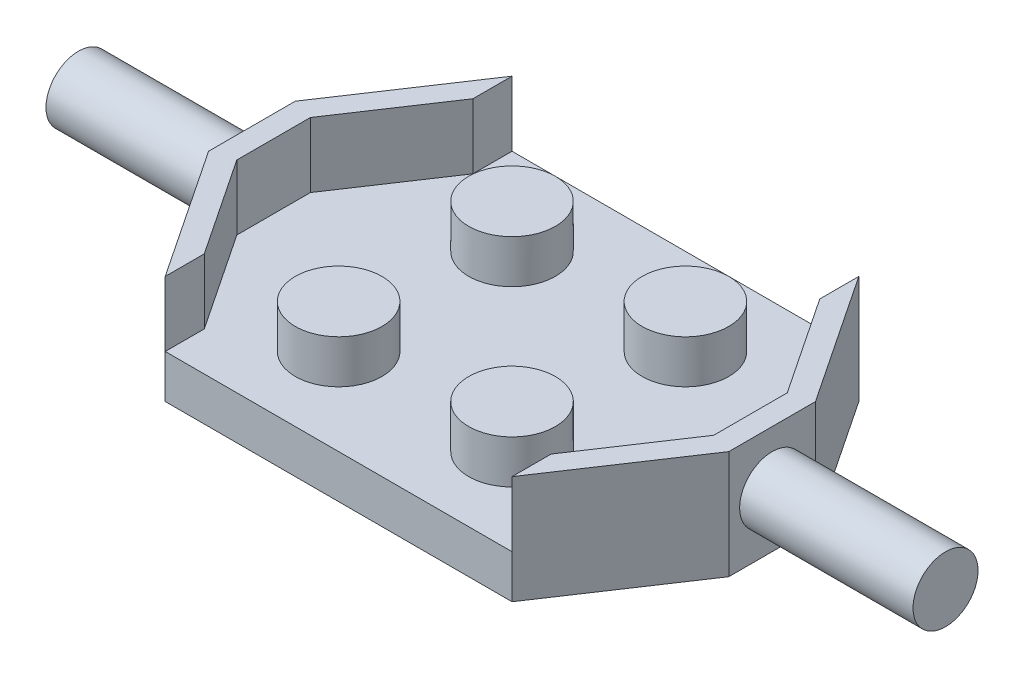
ISO-10303-21;
HEADER;
FILE_DESCRIPTION(('STEP AP214'),'2;1');
FILE_NAME('part.step','',(''),(''),'','','');
FILE_SCHEMA(('AUTOMOTIVE_DESIGN { 1 0 10303 214 1 1 1 1 }'));
ENDSEC;
DATA;
#1=APPLICATION_CONTEXT('core data for automotive mechanical design processes');
#2=APPLICATION_PROTOCOL_DEFINITION('international standard','automotive_design',2000,#1);
#3=PRODUCT_CONTEXT('',#1,'mechanical');
#4=PRODUCT('Part','Part','',(#3));
#5=PRODUCT_RELATED_PRODUCT_CATEGORY('part','',(#4));
#6=PRODUCT_DEFINITION_FORMATION('','',#4);
#7=PRODUCT_DEFINITION_CONTEXT('part definition',#1,'design');
#8=PRODUCT_DEFINITION('design','',#6,#7);
#9=PRODUCT_DEFINITION_SHAPE('','',#8);
#10=(LENGTH_UNIT() NAMED_UNIT(*) SI_UNIT(.MILLI.,.METRE.));
#11=(NAMED_UNIT(*) PLANE_ANGLE_UNIT() SI_UNIT($,.RADIAN.));
#12=(NAMED_UNIT(*) SI_UNIT($,.STERADIAN.) SOLID_ANGLE_UNIT());
#13=UNCERTAINTY_MEASURE_WITH_UNIT(LENGTH_MEASURE(1.E-05),#10,'distance_accuracy_value','');
#14=(GEOMETRIC_REPRESENTATION_CONTEXT(3) GLOBAL_UNCERTAINTY_ASSIGNED_CONTEXT((#13)) GLOBAL_UNIT_ASSIGNED_CONTEXT((#10,
#11,#12)) REPRESENTATION_CONTEXT('',''));
#15=CARTESIAN_POINT('',(0.,0.,0.));
#16=DIRECTION('',(0.,0.,1.));
#17=DIRECTION('',(1.,0.,0.));
#18=AXIS2_PLACEMENT_3D('',#15,#16,#17);
#19=CARTESIAN_POINT('',(0.,2.,0.));
#20=DIRECTION('',(0.,-1.,0.));
#21=DIRECTION('',(0.,0.,-1.));
#22=AXIS2_PLACEMENT_3D('',#19,#20,#21);
#23=PLANE('',#22);
#24=CARTESIAN_POINT('',(-4.,2.,-4.));
#25=DIRECTION('',(0.,-1.,0.));
#26=DIRECTION('',(0.,0.,-1.));
#27=AXIS2_PLACEMENT_3D('',#24,#25,#26);
#28=CIRCLE('',#27,2.);
#29=CARTESIAN_POINT('',(-4.,2.,-6.));
#30=VERTEX_POINT('',#29);
#31=EDGE_CURVE('E412',#30,#30,#28,.F.);
#32=ORIENTED_EDGE('',*,*,#31,.F.);
#33=EDGE_LOOP('',(#32));
#34=FACE_BOUND('',#33,.T.);
#35=CARTESIAN_POINT('',(-4.,2.,4.));
#36=DIRECTION('',(0.,-1.,0.));
#37=DIRECTION('',(0.,0.,-1.));
#38=AXIS2_PLACEMENT_3D('',#35,#36,#37);
#39=CIRCLE('',#38,2.);
#40=CARTESIAN_POINT('',(-4.,2.,2.));
#41=VERTEX_POINT('',#40);
#42=EDGE_CURVE('E48',#41,#41,#39,.F.);
#43=ORIENTED_EDGE('',*,*,#42,.F.);
#44=EDGE_LOOP('',(#43));
#45=FACE_BOUND('',#44,.T.);
#46=DIRECTION('',(0.,0.,-1.));
#47=VECTOR('',#46,1.);
#48=CARTESIAN_POINT('',(-8.,2.,8.));
#49=LINE('',#48,#47);
#50=CARTESIAN_POINT('',(-8.,2.,8.));
#51=VERTEX_POINT('',#50);
#52=CARTESIAN_POINT('',(-8.,2.,6.197224362268));
#53=VERTEX_POINT('',#52);
#54=EDGE_CURVE('E301',#51,#53,#49,.T.);
#55=ORIENTED_EDGE('',*,*,#54,.F.);
#56=DIRECTION('',(1.,0.,0.));
#57=VECTOR('',#56,1.);
#58=CARTESIAN_POINT('',(-8.,2.,8.));
#59=LINE('',#58,#57);
#60=CARTESIAN_POINT('',(8.,2.,8.));
#61=VERTEX_POINT('',#60);
#62=EDGE_CURVE('E376',#51,#61,#59,.T.);
#63=ORIENTED_EDGE('',*,*,#62,.T.);
#64=DIRECTION('',(0.,0.,-1.));
#65=VECTOR('',#64,1.);
#66=CARTESIAN_POINT('',(8.,2.,8.));
#67=LINE('',#66,#65);
#68=CARTESIAN_POINT('',(8.,2.,6.197224362268));
#69=VERTEX_POINT('',#68);
#70=EDGE_CURVE('E230',#61,#69,#67,.T.);
#71=ORIENTED_EDGE('',*,*,#70,.T.);
#72=DIRECTION('',(0.554700196225229,0.,-0.832050294337843));
#73=VECTOR('',#72,1.);
#74=CARTESIAN_POINT('',(11.,2.,1.69722436226801));
#75=LINE('',#74,#73);
#76=CARTESIAN_POINT('',(11.,2.,1.69722436226801));
#77=VERTEX_POINT('',#76);
#78=EDGE_CURVE('E234',#69,#77,#75,.T.);
#79=ORIENTED_EDGE('',*,*,#78,.T.);
#80=DIRECTION('',(0.,0.,-1.));
#81=VECTOR('',#80,1.);
#82=CARTESIAN_POINT('',(11.,2.,-1.69722436226801));
#83=LINE('',#82,#81);
#84=CARTESIAN_POINT('',(11.,2.,-1.69722436226801));
#85=VERTEX_POINT('',#84);
#86=EDGE_CURVE('E239',#77,#85,#83,.T.);
#87=ORIENTED_EDGE('',*,*,#86,.T.);
#88=DIRECTION('',(-0.554700196225229,0.,-0.832050294337843));
#89=VECTOR('',#88,1.);
#90=CARTESIAN_POINT('',(8.,2.,-6.197224362268));
#91=LINE('',#90,#89);
#92=CARTESIAN_POINT('',(8.,2.,-6.197224362268));
#93=VERTEX_POINT('',#92);
#94=EDGE_CURVE('E203',#85,#93,#91,.T.);
#95=ORIENTED_EDGE('',*,*,#94,.T.);
#96=DIRECTION('',(0.,0.,-1.));
#97=VECTOR('',#96,1.);
#98=CARTESIAN_POINT('',(8.,2.,-6.197224362268));
#99=LINE('',#98,#97);
#100=CARTESIAN_POINT('',(8.,2.,-8.));
#101=VERTEX_POINT('',#100);
#102=EDGE_CURVE('E199',#93,#101,#99,.T.);
#103=ORIENTED_EDGE('',*,*,#102,.T.);
#104=DIRECTION('',(-1.,0.,0.));
#105=VECTOR('',#104,1.);
#106=CARTESIAN_POINT('',(-8.,2.,-8.));
#107=LINE('',#106,#105);
#108=CARTESIAN_POINT('',(-8.,2.,-8.));
#109=VERTEX_POINT('',#108);
#110=EDGE_CURVE('E379',#101,#109,#107,.T.);
#111=ORIENTED_EDGE('',*,*,#110,.T.);
#112=DIRECTION('',(0.,0.,-1.));
#113=VECTOR('',#112,1.);
#114=CARTESIAN_POINT('',(-8.,2.,-6.197224362268));
#115=LINE('',#114,#113);
#116=CARTESIAN_POINT('',(-8.,2.,-6.197224362268));
#117=VERTEX_POINT('',#116);
#118=EDGE_CURVE('E308',#117,#109,#115,.T.);
#119=ORIENTED_EDGE('',*,*,#118,.F.);
#120=DIRECTION('',(0.554700196225229,0.,-0.832050294337843));
#121=VECTOR('',#120,1.);
#122=CARTESIAN_POINT('',(-8.,2.,-6.197224362268));
#123=LINE('',#122,#121);
#124=CARTESIAN_POINT('',(-11.,2.,-1.69722436226801));
#125=VERTEX_POINT('',#124);
#126=EDGE_CURVE('E337',#125,#117,#123,.T.);
#127=ORIENTED_EDGE('',*,*,#126,.F.);
#128=DIRECTION('',(0.,0.,-1.));
#129=VECTOR('',#128,1.);
#130=CARTESIAN_POINT('',(-11.,2.,-1.69722436226801));
#131=LINE('',#130,#129);
#132=CARTESIAN_POINT('',(-11.,2.,1.69722436226801));
#133=VERTEX_POINT('',#132);
#134=EDGE_CURVE('E66',#133,#125,#131,.T.);
#135=ORIENTED_EDGE('',*,*,#134,.F.);
#136=DIRECTION('',(-0.554700196225229,0.,-0.832050294337843));
#137=VECTOR('',#136,1.);
#138=CARTESIAN_POINT('',(-11.,2.,1.69722436226801));
#139=LINE('',#138,#137);
#140=EDGE_CURVE('E61',#53,#133,#139,.T.);
#141=ORIENTED_EDGE('',*,*,#140,.F.);
#142=EDGE_LOOP('',(#55,#63,#71,#79,#87,#95,#103,#111,#119,#127,#135,#141));
#143=FACE_BOUND('',#142,.T.);
#144=CARTESIAN_POINT('',(4.,2.,-4.));
#145=DIRECTION('',(0.,1.,0.));
#146=DIRECTION('',(0.,0.,-1.));
#147=AXIS2_PLACEMENT_3D('',#144,#145,#146);
#148=CIRCLE('',#147,2.);
#149=CARTESIAN_POINT('',(4.,2.,-6.));
#150=VERTEX_POINT('',#149);
#151=EDGE_CURVE('E290',#150,#150,#148,.F.);
#152=ORIENTED_EDGE('',*,*,#151,.T.);
#153=EDGE_LOOP('',(#152));
#154=FACE_BOUND('',#153,.T.);
#155=CARTESIAN_POINT('',(4.,2.,4.));
#156=DIRECTION('',(0.,1.,0.));
#157=DIRECTION('',(0.,0.,-1.));
#158=AXIS2_PLACEMENT_3D('',#155,#156,#157);
#159=CIRCLE('',#158,2.);
#160=CARTESIAN_POINT('',(4.,2.,2.));
#161=VERTEX_POINT('',#160);
#162=EDGE_CURVE('E294',#161,#161,#159,.F.);
#163=ORIENTED_EDGE('',*,*,#162,.T.);
#164=EDGE_LOOP('',(#163));
#165=FACE_BOUND('',#164,.T.);
#166=ADVANCED_FACE('F44',(#34,#45,#143,#154,#165),#23,.F.);
#167=CARTESIAN_POINT('',(-8.,2.,8.));
#168=DIRECTION('',(0.,0.,-1.));
#169=DIRECTION('',(-1.,0.,0.));
#170=AXIS2_PLACEMENT_3D('',#167,#168,#169);
#171=PLANE('',#170);
#172=DIRECTION('',(1.,0.,0.));
#173=VECTOR('',#172,1.);
#174=CARTESIAN_POINT('',(-8.,0.,8.));
#175=LINE('',#174,#173);
#176=CARTESIAN_POINT('',(-8.,0.,8.));
#177=VERTEX_POINT('',#176);
#178=CARTESIAN_POINT('',(8.,0.,8.));
#179=VERTEX_POINT('',#178);
#180=EDGE_CURVE('E375',#177,#179,#175,.T.);
#181=ORIENTED_EDGE('',*,*,#180,.T.);
#182=DIRECTION('',(0.,-1.,0.));
#183=VECTOR('',#182,1.);
#184=CARTESIAN_POINT('',(8.,2.,8.));
#185=LINE('',#184,#183);
#186=EDGE_CURVE('E281',#61,#179,#185,.T.);
#187=ORIENTED_EDGE('',*,*,#186,.F.);
#188=ORIENTED_EDGE('',*,*,#62,.F.);
#189=DIRECTION('',(0.,-1.,0.));
#190=VECTOR('',#189,1.);
#191=CARTESIAN_POINT('',(-8.,2.,8.));
#192=LINE('',#191,#190);
#193=EDGE_CURVE('E384',#51,#177,#192,.T.);
#194=ORIENTED_EDGE('',*,*,#193,.T.);
#195=EDGE_LOOP('',(#181,#187,#188,#194));
#196=FACE_BOUND('',#195,.T.);
#197=ADVANCED_FACE('F46',(#196),#171,.F.);
#198=CARTESIAN_POINT('',(-8.,2.,-8.));
#199=DIRECTION('',(0.,0.,1.));
#200=DIRECTION('',(1.,0.,0.));
#201=AXIS2_PLACEMENT_3D('',#198,#199,#200);
#202=PLANE('',#201);
#203=DIRECTION('',(-1.,0.,0.));
#204=VECTOR('',#203,1.);
#205=CARTESIAN_POINT('',(-8.,0.,-8.));
#206=LINE('',#205,#204);
#207=CARTESIAN_POINT('',(8.,0.,-8.));
#208=VERTEX_POINT('',#207);
#209=CARTESIAN_POINT('',(-8.,0.,-8.));
#210=VERTEX_POINT('',#209);
#211=EDGE_CURVE('E387',#208,#210,#206,.T.);
#212=ORIENTED_EDGE('',*,*,#211,.T.);
#213=DIRECTION('',(0.,-1.,0.));
#214=VECTOR('',#213,1.);
#215=CARTESIAN_POINT('',(-8.,2.,-8.));
#216=LINE('',#215,#214);
#217=EDGE_CURVE('E409',#109,#210,#216,.T.);
#218=ORIENTED_EDGE('',*,*,#217,.F.);
#219=ORIENTED_EDGE('',*,*,#110,.F.);
#220=DIRECTION('',(0.,-1.,0.));
#221=VECTOR('',#220,1.);
#222=CARTESIAN_POINT('',(8.,2.,-8.));
#223=LINE('',#222,#221);
#224=EDGE_CURVE('E191',#101,#208,#223,.T.);
#225=ORIENTED_EDGE('',*,*,#224,.T.);
#226=EDGE_LOOP('',(#212,#218,#219,#225));
#227=FACE_BOUND('',#226,.T.);
#228=ADVANCED_FACE('F524',(#227),#202,.F.);
#229=CARTESIAN_POINT('',(-12.,2.,-2.));
#230=DIRECTION('',(0.832050294337844,0.,0.554700196225229));
#231=DIRECTION('',(0.554700196225229,0.,-0.832050294337844));
#232=AXIS2_PLACEMENT_3D('',#229,#230,#231);
#233=PLANE('',#232);
#234=DIRECTION('',(-0.554700196225229,0.,0.832050294337844));
#235=VECTOR('',#234,1.);
#236=CARTESIAN_POINT('',(-12.,0.,-2.));
#237=LINE('',#236,#235);
#238=CARTESIAN_POINT('',(-12.,0.,-2.));
#239=VERTEX_POINT('',#238);
#240=EDGE_CURVE('E390',#210,#239,#237,.T.);
#241=ORIENTED_EDGE('',*,*,#240,.T.);
#242=DIRECTION('',(0.,-1.,0.));
#243=VECTOR('',#242,1.);
#244=CARTESIAN_POINT('',(-12.,2.,-2.));
#245=LINE('',#244,#243);
#246=CARTESIAN_POINT('',(-12.,5.,-2.));
#247=VERTEX_POINT('',#246);
#248=EDGE_CURVE('E405',#247,#239,#245,.T.);
#249=ORIENTED_EDGE('',*,*,#248,.F.);
#250=DIRECTION('',(-0.554700196225229,0.,0.832050294337844));
#251=VECTOR('',#250,1.);
#252=CARTESIAN_POINT('',(-8.,5.,-8.));
#253=LINE('',#252,#251);
#254=CARTESIAN_POINT('',(-8.,5.,-8.));
#255=VERTEX_POINT('',#254);
#256=EDGE_CURVE('E303',#255,#247,#253,.T.);
#257=ORIENTED_EDGE('',*,*,#256,.F.);
#258=DIRECTION('',(0.,-1.,0.));
#259=VECTOR('',#258,1.);
#260=CARTESIAN_POINT('',(-8.,5.,-8.));
#261=LINE('',#260,#259);
#262=EDGE_CURVE('E330',#255,#109,#261,.T.);
#263=ORIENTED_EDGE('',*,*,#262,.T.);
#264=ORIENTED_EDGE('',*,*,#217,.T.);
#265=EDGE_LOOP('',(#241,#249,#257,#263,#264));
#266=FACE_BOUND('',#265,.T.);
#267=ADVANCED_FACE('F521',(#266),#233,.F.);
#268=CARTESIAN_POINT('',(-12.,2.,2.));
#269=DIRECTION('',(1.,0.,0.));
#270=DIRECTION('',(0.,0.,-1.));
#271=AXIS2_PLACEMENT_3D('',#268,#269,#270);
#272=PLANE('',#271);
#273=CARTESIAN_POINT('',(-12.,2.5,0.));
#274=DIRECTION('',(-1.,0.,0.));
#275=DIRECTION('',(0.,0.,1.));
#276=AXIS2_PLACEMENT_3D('',#273,#274,#275);
#277=CIRCLE('',#276,1.5);
#278=CARTESIAN_POINT('',(-12.,2.5,1.5));
#279=VERTEX_POINT('',#278);
#280=EDGE_CURVE('E11',#279,#279,#277,.T.);
#281=ORIENTED_EDGE('',*,*,#280,.F.);
#282=EDGE_LOOP('',(#281));
#283=FACE_BOUND('',#282,.T.);
#284=DIRECTION('',(0.,0.,1.));
#285=VECTOR('',#284,1.);
#286=CARTESIAN_POINT('',(-12.,0.,2.));
#287=LINE('',#286,#285);
#288=CARTESIAN_POINT('',(-12.,0.,2.));
#289=VERTEX_POINT('',#288);
#290=EDGE_CURVE('E393',#239,#289,#287,.T.);
#291=ORIENTED_EDGE('',*,*,#290,.T.);
#292=DIRECTION('',(0.,-1.,0.));
#293=VECTOR('',#292,1.);
#294=CARTESIAN_POINT('',(-12.,2.,2.));
#295=LINE('',#294,#293);
#296=CARTESIAN_POINT('',(-12.,5.,2.));
#297=VERTEX_POINT('',#296);
#298=EDGE_CURVE('E401',#297,#289,#295,.T.);
#299=ORIENTED_EDGE('',*,*,#298,.F.);
#300=DIRECTION('',(0.,0.,1.));
#301=VECTOR('',#300,1.);
#302=CARTESIAN_POINT('',(-12.,5.,-2.));
#303=LINE('',#302,#301);
#304=EDGE_CURVE('E307',#247,#297,#303,.T.);
#305=ORIENTED_EDGE('',*,*,#304,.F.);
#306=ORIENTED_EDGE('',*,*,#248,.T.);
#307=EDGE_LOOP('',(#291,#299,#305,#306));
#308=FACE_BOUND('',#307,.T.);
#309=ADVANCED_FACE('F517',(#283,#308),#272,.F.);
#310=CARTESIAN_POINT('',(-12.,2.,2.));
#311=DIRECTION('',(0.832050294337844,0.,-0.554700196225229));
#312=DIRECTION('',(-0.554700196225229,0.,-0.832050294337844));
#313=AXIS2_PLACEMENT_3D('',#310,#311,#312);
#314=PLANE('',#313);
#315=DIRECTION('',(0.554700196225229,0.,0.832050294337844));
#316=VECTOR('',#315,1.);
#317=CARTESIAN_POINT('',(-12.,0.,2.));
#318=LINE('',#317,#316);
#319=EDGE_CURVE('E380',#289,#177,#318,.T.);
#320=ORIENTED_EDGE('',*,*,#319,.T.);
#321=ORIENTED_EDGE('',*,*,#193,.F.);
#322=DIRECTION('',(0.,-1.,0.));
#323=VECTOR('',#322,1.);
#324=CARTESIAN_POINT('',(-8.,5.,8.));
#325=LINE('',#324,#323);
#326=CARTESIAN_POINT('',(-8.,5.,8.));
#327=VERTEX_POINT('',#326);
#328=EDGE_CURVE('E363',#327,#51,#325,.T.);
#329=ORIENTED_EDGE('',*,*,#328,.F.);
#330=DIRECTION('',(0.554700196225229,0.,0.832050294337844));
#331=VECTOR('',#330,1.);
#332=CARTESIAN_POINT('',(-12.,5.,2.));
#333=LINE('',#332,#331);
#334=EDGE_CURVE('E312',#297,#327,#333,.T.);
#335=ORIENTED_EDGE('',*,*,#334,.F.);
#336=ORIENTED_EDGE('',*,*,#298,.T.);
#337=EDGE_LOOP('',(#320,#321,#329,#335,#336));
#338=FACE_BOUND('',#337,.T.);
#339=ADVANCED_FACE('F513',(#338),#314,.F.);
#340=CARTESIAN_POINT('',(0.,0.,0.));
#341=DIRECTION('',(0.,-1.,0.));
#342=DIRECTION('',(0.,0.,-1.));
#343=AXIS2_PLACEMENT_3D('',#340,#341,#342);
#344=PLANE('',#343);
#345=ORIENTED_EDGE('',*,*,#180,.F.);
#346=ORIENTED_EDGE('',*,*,#319,.F.);
#347=ORIENTED_EDGE('',*,*,#290,.F.);
#348=ORIENTED_EDGE('',*,*,#240,.F.);
#349=ORIENTED_EDGE('',*,*,#211,.F.);
#350=DIRECTION('',(0.554700196225229,0.,0.832050294337844));
#351=VECTOR('',#350,1.);
#352=CARTESIAN_POINT('',(12.,0.,-2.));
#353=LINE('',#352,#351);
#354=CARTESIAN_POINT('',(12.,0.,-2.));
#355=VERTEX_POINT('',#354);
#356=EDGE_CURVE('E272',#208,#355,#353,.T.);
#357=ORIENTED_EDGE('',*,*,#356,.T.);
#358=DIRECTION('',(0.,0.,1.));
#359=VECTOR('',#358,1.);
#360=CARTESIAN_POINT('',(12.,0.,2.));
#361=LINE('',#360,#359);
#362=CARTESIAN_POINT('',(12.,0.,2.));
#363=VERTEX_POINT('',#362);
#364=EDGE_CURVE('E186',#355,#363,#361,.T.);
#365=ORIENTED_EDGE('',*,*,#364,.T.);
#366=DIRECTION('',(-0.554700196225229,0.,0.832050294337844));
#367=VECTOR('',#366,1.);
#368=CARTESIAN_POINT('',(12.,0.,2.));
#369=LINE('',#368,#367);
#370=EDGE_CURVE('E277',#363,#179,#369,.T.);
#371=ORIENTED_EDGE('',*,*,#370,.T.);
#372=EDGE_LOOP('',(#345,#346,#347,#348,#349,#357,#365,#371));
#373=FACE_BOUND('',#372,.T.);
#374=ADVANCED_FACE('F508',(#373),#344,.T.);
#375=CARTESIAN_POINT('',(-4.,4.,-4.));
#376=DIRECTION('',(0.,-1.,0.));
#377=DIRECTION('',(0.,0.,-1.));
#378=AXIS2_PLACEMENT_3D('',#375,#376,#377);
#379=CYLINDRICAL_SURFACE('',#378,2.);
#380=CARTESIAN_POINT('',(-4.,4.,-4.));
#381=DIRECTION('',(0.,1.,0.));
#382=DIRECTION('',(0.,0.,1.));
#383=AXIS2_PLACEMENT_3D('',#380,#381,#382);
#384=CIRCLE('',#383,2.);
#385=CARTESIAN_POINT('',(-4.,4.,-2.));
#386=VERTEX_POINT('',#385);
#387=EDGE_CURVE('E371',#386,#386,#384,.T.);
#388=ORIENTED_EDGE('',*,*,#387,.F.);
#389=EDGE_LOOP('',(#388));
#390=FACE_BOUND('',#389,.T.);
#391=ORIENTED_EDGE('',*,*,#31,.T.);
#392=EDGE_LOOP('',(#391));
#393=FACE_BOUND('',#392,.T.);
#394=ADVANCED_FACE('F505',(#390,#393),#379,.T.);
#395=CARTESIAN_POINT('',(-4.,4.,-4.));
#396=DIRECTION('',(0.,1.,0.));
#397=DIRECTION('',(0.,0.,1.));
#398=AXIS2_PLACEMENT_3D('',#395,#396,#397);
#399=PLANE('',#398);
#400=ORIENTED_EDGE('',*,*,#387,.T.);
#401=EDGE_LOOP('',(#400));
#402=FACE_BOUND('',#401,.T.);
#403=ADVANCED_FACE('F498',(#402),#399,.T.);
#404=CARTESIAN_POINT('',(-4.,4.,4.));
#405=DIRECTION('',(0.,-1.,0.));
#406=DIRECTION('',(0.,0.,-1.));
#407=AXIS2_PLACEMENT_3D('',#404,#405,#406);
#408=CYLINDRICAL_SURFACE('',#407,2.);
#409=CARTESIAN_POINT('',(-4.,4.,4.));
#410=DIRECTION('',(0.,1.,0.));
#411=DIRECTION('',(0.,0.,-1.));
#412=AXIS2_PLACEMENT_3D('',#409,#410,#411);
#413=CIRCLE('',#412,2.);
#414=CARTESIAN_POINT('',(-4.,4.,2.));
#415=VERTEX_POINT('',#414);
#416=EDGE_CURVE('E367',#415,#415,#413,.T.);
#417=ORIENTED_EDGE('',*,*,#416,.F.);
#418=EDGE_LOOP('',(#417));
#419=FACE_BOUND('',#418,.T.);
#420=ORIENTED_EDGE('',*,*,#42,.T.);
#421=EDGE_LOOP('',(#420));
#422=FACE_BOUND('',#421,.T.);
#423=ADVANCED_FACE('F421',(#419,#422),#408,.T.);
#424=CARTESIAN_POINT('',(-4.,4.,4.));
#425=DIRECTION('',(0.,-1.,0.));
#426=DIRECTION('',(0.,0.,-1.));
#427=AXIS2_PLACEMENT_3D('',#424,#425,#426);
#428=PLANE('',#427);
#429=ORIENTED_EDGE('',*,*,#416,.T.);
#430=EDGE_LOOP('',(#429));
#431=FACE_BOUND('',#430,.T.);
#432=ADVANCED_FACE('F494',(#431),#428,.F.);
#433=CARTESIAN_POINT('',(-8.,5.,8.));
#434=DIRECTION('',(-1.,0.,0.));
#435=DIRECTION('',(0.,0.,1.));
#436=AXIS2_PLACEMENT_3D('',#433,#434,#435);
#437=PLANE('',#436);
#438=ORIENTED_EDGE('',*,*,#54,.T.);
#439=DIRECTION('',(0.,-1.,0.));
#440=VECTOR('',#439,1.);
#441=CARTESIAN_POINT('',(-8.,5.,6.197224362268));
#442=LINE('',#441,#440);
#443=CARTESIAN_POINT('',(-8.,5.,6.197224362268));
#444=VERTEX_POINT('',#443);
#445=EDGE_CURVE('E359',#444,#53,#442,.T.);
#446=ORIENTED_EDGE('',*,*,#445,.F.);
#447=DIRECTION('',(0.,0.,-1.));
#448=VECTOR('',#447,1.);
#449=CARTESIAN_POINT('',(-8.,5.,8.));
#450=LINE('',#449,#448);
#451=EDGE_CURVE('E315',#327,#444,#450,.T.);
#452=ORIENTED_EDGE('',*,*,#451,.F.);
#453=ORIENTED_EDGE('',*,*,#328,.T.);
#454=EDGE_LOOP('',(#438,#446,#452,#453));
#455=FACE_BOUND('',#454,.T.);
#456=ADVANCED_FACE('F490',(#455),#437,.F.);
#457=CARTESIAN_POINT('',(-11.,5.,1.69722436226801));
#458=DIRECTION('',(-0.832050294337843,0.,0.55470019622523));
#459=DIRECTION('',(0.55470019622523,0.,0.832050294337843));
#460=AXIS2_PLACEMENT_3D('',#457,#458,#459);
#461=PLANE('',#460);
#462=ORIENTED_EDGE('',*,*,#140,.T.);
#463=DIRECTION('',(0.,-1.,0.));
#464=VECTOR('',#463,1.);
#465=CARTESIAN_POINT('',(-11.,5.,1.69722436226801));
#466=LINE('',#465,#464);
#467=CARTESIAN_POINT('',(-11.,5.,1.69722436226801));
#468=VERTEX_POINT('',#467);
#469=EDGE_CURVE('E355',#468,#133,#466,.T.);
#470=ORIENTED_EDGE('',*,*,#469,.F.);
#471=DIRECTION('',(-0.554700196225229,0.,-0.832050294337843));
#472=VECTOR('',#471,1.);
#473=CARTESIAN_POINT('',(-11.,5.,1.69722436226801));
#474=LINE('',#473,#472);
#475=EDGE_CURVE('E318',#444,#468,#474,.T.);
#476=ORIENTED_EDGE('',*,*,#475,.F.);
#477=ORIENTED_EDGE('',*,*,#445,.T.);
#478=EDGE_LOOP('',(#462,#470,#476,#477));
#479=FACE_BOUND('',#478,.T.);
#480=ADVANCED_FACE('F486',(#479),#461,.F.);
#481=CARTESIAN_POINT('',(-11.,5.,-1.69722436226801));
#482=DIRECTION('',(-1.,0.,0.));
#483=DIRECTION('',(0.,0.,1.));
#484=AXIS2_PLACEMENT_3D('',#481,#482,#483);
#485=PLANE('',#484);
#486=ORIENTED_EDGE('',*,*,#134,.T.);
#487=DIRECTION('',(0.,-1.,0.));
#488=VECTOR('',#487,1.);
#489=CARTESIAN_POINT('',(-11.,5.,-1.69722436226801));
#490=LINE('',#489,#488);
#491=CARTESIAN_POINT('',(-11.,5.,-1.69722436226801));
#492=VERTEX_POINT('',#491);
#493=EDGE_CURVE('E351',#492,#125,#490,.T.);
#494=ORIENTED_EDGE('',*,*,#493,.F.);
#495=DIRECTION('',(0.,0.,-1.));
#496=VECTOR('',#495,1.);
#497=CARTESIAN_POINT('',(-11.,5.,-1.69722436226801));
#498=LINE('',#497,#496);
#499=EDGE_CURVE('E321',#468,#492,#498,.T.);
#500=ORIENTED_EDGE('',*,*,#499,.F.);
#501=ORIENTED_EDGE('',*,*,#469,.T.);
#502=EDGE_LOOP('',(#486,#494,#500,#501));
#503=FACE_BOUND('',#502,.T.);
#504=ADVANCED_FACE('F482',(#503),#485,.F.);
#505=CARTESIAN_POINT('',(-8.,5.,-6.197224362268));
#506=DIRECTION('',(-0.832050294337843,0.,-0.554700196225229));
#507=DIRECTION('',(-0.554700196225229,0.,0.832050294337844));
#508=AXIS2_PLACEMENT_3D('',#505,#506,#507);
#509=PLANE('',#508);
#510=ORIENTED_EDGE('',*,*,#126,.T.);
#511=DIRECTION('',(0.,-1.,0.));
#512=VECTOR('',#511,1.);
#513=CARTESIAN_POINT('',(-8.,5.,-6.197224362268));
#514=LINE('',#513,#512);
#515=CARTESIAN_POINT('',(-8.,5.,-6.197224362268));
#516=VERTEX_POINT('',#515);
#517=EDGE_CURVE('E347',#516,#117,#514,.T.);
#518=ORIENTED_EDGE('',*,*,#517,.F.);
#519=DIRECTION('',(0.554700196225229,0.,-0.832050294337843));
#520=VECTOR('',#519,1.);
#521=CARTESIAN_POINT('',(-8.,5.,-6.197224362268));
#522=LINE('',#521,#520);
#523=EDGE_CURVE('E324',#492,#516,#522,.T.);
#524=ORIENTED_EDGE('',*,*,#523,.F.);
#525=ORIENTED_EDGE('',*,*,#493,.T.);
#526=EDGE_LOOP('',(#510,#518,#524,#525));
#527=FACE_BOUND('',#526,.T.);
#528=ADVANCED_FACE('F478',(#527),#509,.F.);
#529=CARTESIAN_POINT('',(-8.,5.,-6.197224362268));
#530=DIRECTION('',(-1.,0.,0.));
#531=DIRECTION('',(0.,0.,1.));
#532=AXIS2_PLACEMENT_3D('',#529,#530,#531);
#533=PLANE('',#532);
#534=ORIENTED_EDGE('',*,*,#118,.T.);
#535=ORIENTED_EDGE('',*,*,#262,.F.);
#536=DIRECTION('',(0.,0.,-1.));
#537=VECTOR('',#536,1.);
#538=CARTESIAN_POINT('',(-8.,5.,-6.197224362268));
#539=LINE('',#538,#537);
#540=EDGE_CURVE('E327',#516,#255,#539,.T.);
#541=ORIENTED_EDGE('',*,*,#540,.F.);
#542=ORIENTED_EDGE('',*,*,#517,.T.);
#543=EDGE_LOOP('',(#534,#535,#541,#542));
#544=FACE_BOUND('',#543,.T.);
#545=ADVANCED_FACE('F474',(#544),#533,.F.);
#546=CARTESIAN_POINT('',(0.,5.,0.));
#547=DIRECTION('',(0.,1.,0.));
#548=DIRECTION('',(0.,0.,1.));
#549=AXIS2_PLACEMENT_3D('',#546,#547,#548);
#550=PLANE('',#549);
#551=ORIENTED_EDGE('',*,*,#256,.T.);
#552=ORIENTED_EDGE('',*,*,#304,.T.);
#553=ORIENTED_EDGE('',*,*,#334,.T.);
#554=ORIENTED_EDGE('',*,*,#451,.T.);
#555=ORIENTED_EDGE('',*,*,#475,.T.);
#556=ORIENTED_EDGE('',*,*,#499,.T.);
#557=ORIENTED_EDGE('',*,*,#523,.T.);
#558=ORIENTED_EDGE('',*,*,#540,.T.);
#559=EDGE_LOOP('',(#551,#552,#553,#554,#555,#556,#557,#558));
#560=FACE_BOUND('',#559,.T.);
#561=ADVANCED_FACE('F470',(#560),#550,.T.);
#562=CARTESIAN_POINT('',(-20.,2.5,0.));
#563=DIRECTION('',(1.,0.,0.));
#564=DIRECTION('',(0.,0.,-1.));
#565=AXIS2_PLACEMENT_3D('',#562,#563,#564);
#566=CYLINDRICAL_SURFACE('',#565,1.5);
#567=CARTESIAN_POINT('',(-20.,2.5,0.));
#568=DIRECTION('',(-1.,0.,0.));
#569=DIRECTION('',(0.,0.,1.));
#570=AXIS2_PLACEMENT_3D('',#567,#568,#569);
#571=CIRCLE('',#570,1.5);
#572=CARTESIAN_POINT('',(-20.,2.5,1.5));
#573=VERTEX_POINT('',#572);
#574=EDGE_CURVE('E298',#573,#573,#571,.T.);
#575=ORIENTED_EDGE('',*,*,#574,.F.);
#576=EDGE_LOOP('',(#575));
#577=FACE_BOUND('',#576,.T.);
#578=ORIENTED_EDGE('',*,*,#280,.T.);
#579=EDGE_LOOP('',(#578));
#580=FACE_BOUND('',#579,.T.);
#581=ADVANCED_FACE('F466',(#577,#580),#566,.T.);
#582=CARTESIAN_POINT('',(-20.,2.5,0.));
#583=DIRECTION('',(-1.,0.,0.));
#584=DIRECTION('',(0.,0.,1.));
#585=AXIS2_PLACEMENT_3D('',#582,#583,#584);
#586=PLANE('',#585);
#587=ORIENTED_EDGE('',*,*,#574,.T.);
#588=EDGE_LOOP('',(#587));
#589=FACE_BOUND('',#588,.T.);
#590=ADVANCED_FACE('F463',(#589),#586,.T.);
#591=CARTESIAN_POINT('',(12.,2.,-2.));
#592=DIRECTION('',(-0.832050294337844,0.,0.554700196225229));
#593=DIRECTION('',(-0.554700196225229,0.,-0.832050294337844));
#594=AXIS2_PLACEMENT_3D('',#591,#592,#593);
#595=PLANE('',#594);
#596=ORIENTED_EDGE('',*,*,#356,.F.);
#597=ORIENTED_EDGE('',*,*,#224,.F.);
#598=DIRECTION('',(0.,-1.,0.));
#599=VECTOR('',#598,1.);
#600=CARTESIAN_POINT('',(8.,5.,-8.));
#601=LINE('',#600,#599);
#602=CARTESIAN_POINT('',(8.,5.,-8.));
#603=VERTEX_POINT('',#602);
#604=EDGE_CURVE('E197',#603,#101,#601,.T.);
#605=ORIENTED_EDGE('',*,*,#604,.F.);
#606=DIRECTION('',(0.554700196225229,0.,0.832050294337844));
#607=VECTOR('',#606,1.);
#608=CARTESIAN_POINT('',(8.,5.,-8.));
#609=LINE('',#608,#607);
#610=CARTESIAN_POINT('',(12.,5.,-2.));
#611=VERTEX_POINT('',#610);
#612=EDGE_CURVE('E173',#603,#611,#609,.T.);
#613=ORIENTED_EDGE('',*,*,#612,.T.);
#614=DIRECTION('',(0.,-1.,0.));
#615=VECTOR('',#614,1.);
#616=CARTESIAN_POINT('',(12.,2.,-2.));
#617=LINE('',#616,#615);
#618=EDGE_CURVE('E183',#611,#355,#617,.T.);
#619=ORIENTED_EDGE('',*,*,#618,.T.);
#620=EDGE_LOOP('',(#596,#597,#605,#613,#619));
#621=FACE_BOUND('',#620,.T.);
#622=ADVANCED_FACE('F194',(#621),#595,.F.);
#623=CARTESIAN_POINT('',(12.,2.,2.));
#624=DIRECTION('',(-1.,0.,0.));
#625=DIRECTION('',(0.,0.,-1.));
#626=AXIS2_PLACEMENT_3D('',#623,#624,#625);
#627=PLANE('',#626);
#628=CARTESIAN_POINT('',(12.,2.5,0.));
#629=DIRECTION('',(-1.,0.,0.));
#630=DIRECTION('',(0.,0.,1.));
#631=AXIS2_PLACEMENT_3D('',#628,#629,#630);
#632=CIRCLE('',#631,1.5);
#633=CARTESIAN_POINT('',(12.,2.5,1.5));
#634=VERTEX_POINT('',#633);
#635=EDGE_CURVE('E206',#634,#634,#632,.T.);
#636=ORIENTED_EDGE('',*,*,#635,.T.);
#637=EDGE_LOOP('',(#636));
#638=FACE_BOUND('',#637,.T.);
#639=ORIENTED_EDGE('',*,*,#364,.F.);
#640=ORIENTED_EDGE('',*,*,#618,.F.);
#641=DIRECTION('',(0.,0.,1.));
#642=VECTOR('',#641,1.);
#643=CARTESIAN_POINT('',(12.,5.,-2.));
#644=LINE('',#643,#642);
#645=CARTESIAN_POINT('',(12.,5.,2.));
#646=VERTEX_POINT('',#645);
#647=EDGE_CURVE('E169',#611,#646,#644,.T.);
#648=ORIENTED_EDGE('',*,*,#647,.T.);
#649=DIRECTION('',(0.,-1.,0.));
#650=VECTOR('',#649,1.);
#651=CARTESIAN_POINT('',(12.,2.,2.));
#652=LINE('',#651,#650);
#653=EDGE_CURVE('E192',#646,#363,#652,.T.);
#654=ORIENTED_EDGE('',*,*,#653,.T.);
#655=EDGE_LOOP('',(#639,#640,#648,#654));
#656=FACE_BOUND('',#655,.T.);
#657=ADVANCED_FACE('F184',(#638,#656),#627,.F.);
#658=CARTESIAN_POINT('',(12.,2.,2.));
#659=DIRECTION('',(-0.832050294337844,0.,-0.554700196225229));
#660=DIRECTION('',(0.554700196225229,0.,-0.832050294337844));
#661=AXIS2_PLACEMENT_3D('',#658,#659,#660);
#662=PLANE('',#661);
#663=ORIENTED_EDGE('',*,*,#370,.F.);
#664=ORIENTED_EDGE('',*,*,#653,.F.);
#665=DIRECTION('',(-0.554700196225229,0.,0.832050294337844));
#666=VECTOR('',#665,1.);
#667=CARTESIAN_POINT('',(12.,5.,2.));
#668=LINE('',#667,#666);
#669=CARTESIAN_POINT('',(8.,5.,8.));
#670=VERTEX_POINT('',#669);
#671=EDGE_CURVE('E176',#646,#670,#668,.T.);
#672=ORIENTED_EDGE('',*,*,#671,.T.);
#673=DIRECTION('',(0.,-1.,0.));
#674=VECTOR('',#673,1.);
#675=CARTESIAN_POINT('',(8.,5.,8.));
#676=LINE('',#675,#674);
#677=EDGE_CURVE('E260',#670,#61,#676,.T.);
#678=ORIENTED_EDGE('',*,*,#677,.T.);
#679=ORIENTED_EDGE('',*,*,#186,.T.);
#680=EDGE_LOOP('',(#663,#664,#672,#678,#679));
#681=FACE_BOUND('',#680,.T.);
#682=ADVANCED_FACE('F453',(#681),#662,.F.);
#683=CARTESIAN_POINT('',(4.,4.,-4.));
#684=DIRECTION('',(0.,-1.,0.));
#685=DIRECTION('',(0.,0.,-1.));
#686=AXIS2_PLACEMENT_3D('',#683,#684,#685);
#687=CYLINDRICAL_SURFACE('',#686,2.);
#688=CARTESIAN_POINT('',(4.,4.,-4.));
#689=DIRECTION('',(0.,-1.,0.));
#690=DIRECTION('',(0.,0.,1.));
#691=AXIS2_PLACEMENT_3D('',#688,#689,#690);
#692=CIRCLE('',#691,2.);
#693=CARTESIAN_POINT('',(4.,4.,-2.));
#694=VERTEX_POINT('',#693);
#695=EDGE_CURVE('E268',#694,#694,#692,.T.);
#696=ORIENTED_EDGE('',*,*,#695,.T.);
#697=EDGE_LOOP('',(#696));
#698=FACE_BOUND('',#697,.T.);
#699=ORIENTED_EDGE('',*,*,#151,.F.);
#700=EDGE_LOOP('',(#699));
#701=FACE_BOUND('',#700,.T.);
#702=ADVANCED_FACE('F445',(#698,#701),#687,.T.);
#703=CARTESIAN_POINT('',(4.,4.,-4.));
#704=DIRECTION('',(0.,1.,0.));
#705=DIRECTION('',(0.,0.,1.));
#706=AXIS2_PLACEMENT_3D('',#703,#704,#705);
#707=PLANE('',#706);
#708=ORIENTED_EDGE('',*,*,#695,.F.);
#709=EDGE_LOOP('',(#708));
#710=FACE_BOUND('',#709,.T.);
#711=ADVANCED_FACE('F435',(#710),#707,.T.);
#712=CARTESIAN_POINT('',(4.,4.,4.));
#713=DIRECTION('',(0.,-1.,0.));
#714=DIRECTION('',(0.,0.,-1.));
#715=AXIS2_PLACEMENT_3D('',#712,#713,#714);
#716=CYLINDRICAL_SURFACE('',#715,2.);
#717=CARTESIAN_POINT('',(4.,4.,4.));
#718=DIRECTION('',(0.,-1.,0.));
#719=DIRECTION('',(0.,0.,-1.));
#720=AXIS2_PLACEMENT_3D('',#717,#718,#719);
#721=CIRCLE('',#720,2.);
#722=CARTESIAN_POINT('',(4.,4.,2.));
#723=VERTEX_POINT('',#722);
#724=EDGE_CURVE('E264',#723,#723,#721,.T.);
#725=ORIENTED_EDGE('',*,*,#724,.T.);
#726=EDGE_LOOP('',(#725));
#727=FACE_BOUND('',#726,.T.);
#728=ORIENTED_EDGE('',*,*,#162,.F.);
#729=EDGE_LOOP('',(#728));
#730=FACE_BOUND('',#729,.T.);
#731=ADVANCED_FACE('F432',(#727,#730),#716,.T.);
#732=CARTESIAN_POINT('',(4.,4.,4.));
#733=DIRECTION('',(0.,-1.,0.));
#734=DIRECTION('',(0.,0.,-1.));
#735=AXIS2_PLACEMENT_3D('',#732,#733,#734);
#736=PLANE('',#735);
#737=ORIENTED_EDGE('',*,*,#724,.F.);
#738=EDGE_LOOP('',(#737));
#739=FACE_BOUND('',#738,.T.);
#740=ADVANCED_FACE('F434',(#739),#736,.F.);
#741=CARTESIAN_POINT('',(8.,5.,8.));
#742=DIRECTION('',(1.,0.,0.));
#743=DIRECTION('',(0.,0.,1.));
#744=AXIS2_PLACEMENT_3D('',#741,#742,#743);
#745=PLANE('',#744);
#746=ORIENTED_EDGE('',*,*,#70,.F.);
#747=ORIENTED_EDGE('',*,*,#677,.F.);
#748=DIRECTION('',(0.,0.,-1.));
#749=VECTOR('',#748,1.);
#750=CARTESIAN_POINT('',(8.,5.,8.));
#751=LINE('',#750,#749);
#752=CARTESIAN_POINT('',(8.,5.,6.197224362268));
#753=VERTEX_POINT('',#752);
#754=EDGE_CURVE('E211',#670,#753,#751,.T.);
#755=ORIENTED_EDGE('',*,*,#754,.T.);
#756=DIRECTION('',(0.,-1.,0.));
#757=VECTOR('',#756,1.);
#758=CARTESIAN_POINT('',(8.,5.,6.197224362268));
#759=LINE('',#758,#757);
#760=EDGE_CURVE('E257',#753,#69,#759,.T.);
#761=ORIENTED_EDGE('',*,*,#760,.T.);
#762=EDGE_LOOP('',(#746,#747,#755,#761));
#763=FACE_BOUND('',#762,.T.);
#764=ADVANCED_FACE('F442',(#763),#745,.F.);
#765=CARTESIAN_POINT('',(11.,5.,1.69722436226801));
#766=DIRECTION('',(0.832050294337843,0.,0.55470019622523));
#767=DIRECTION('',(-0.55470019622523,0.,0.832050294337843));
#768=AXIS2_PLACEMENT_3D('',#765,#766,#767);
#769=PLANE('',#768);
#770=ORIENTED_EDGE('',*,*,#78,.F.);
#771=ORIENTED_EDGE('',*,*,#760,.F.);
#772=DIRECTION('',(0.554700196225229,0.,-0.832050294337843));
#773=VECTOR('',#772,1.);
#774=CARTESIAN_POINT('',(11.,5.,1.69722436226801));
#775=LINE('',#774,#773);
#776=CARTESIAN_POINT('',(11.,5.,1.69722436226801));
#777=VERTEX_POINT('',#776);
#778=EDGE_CURVE('E215',#753,#777,#775,.T.);
#779=ORIENTED_EDGE('',*,*,#778,.T.);
#780=DIRECTION('',(0.,-1.,0.));
#781=VECTOR('',#780,1.);
#782=CARTESIAN_POINT('',(11.,5.,1.69722436226801));
#783=LINE('',#782,#781);
#784=EDGE_CURVE('E254',#777,#77,#783,.T.);
#785=ORIENTED_EDGE('',*,*,#784,.T.);
#786=EDGE_LOOP('',(#770,#771,#779,#785));
#787=FACE_BOUND('',#786,.T.);
#788=ADVANCED_FACE('F564',(#787),#769,.F.);
#789=CARTESIAN_POINT('',(11.,5.,-1.69722436226801));
#790=DIRECTION('',(1.,0.,0.));
#791=DIRECTION('',(0.,0.,1.));
#792=AXIS2_PLACEMENT_3D('',#789,#790,#791);
#793=PLANE('',#792);
#794=ORIENTED_EDGE('',*,*,#86,.F.);
#795=ORIENTED_EDGE('',*,*,#784,.F.);
#796=DIRECTION('',(0.,0.,-1.));
#797=VECTOR('',#796,1.);
#798=CARTESIAN_POINT('',(11.,5.,-1.69722436226801));
#799=LINE('',#798,#797);
#800=CARTESIAN_POINT('',(11.,5.,-1.69722436226801));
#801=VERTEX_POINT('',#800);
#802=EDGE_CURVE('E219',#777,#801,#799,.T.);
#803=ORIENTED_EDGE('',*,*,#802,.T.);
#804=DIRECTION('',(0.,-1.,0.));
#805=VECTOR('',#804,1.);
#806=CARTESIAN_POINT('',(11.,5.,-1.69722436226801));
#807=LINE('',#806,#805);
#808=EDGE_CURVE('E251',#801,#85,#807,.T.);
#809=ORIENTED_EDGE('',*,*,#808,.T.);
#810=EDGE_LOOP('',(#794,#795,#803,#809));
#811=FACE_BOUND('',#810,.T.);
#812=ADVANCED_FACE('F567',(#811),#793,.F.);
#813=CARTESIAN_POINT('',(8.,5.,-6.197224362268));
#814=DIRECTION('',(0.832050294337843,0.,-0.554700196225229));
#815=DIRECTION('',(0.554700196225229,0.,0.832050294337844));
#816=AXIS2_PLACEMENT_3D('',#813,#814,#815);
#817=PLANE('',#816);
#818=ORIENTED_EDGE('',*,*,#94,.F.);
#819=ORIENTED_EDGE('',*,*,#808,.F.);
#820=DIRECTION('',(-0.554700196225229,0.,-0.832050294337843));
#821=VECTOR('',#820,1.);
#822=CARTESIAN_POINT('',(8.,5.,-6.197224362268));
#823=LINE('',#822,#821);
#824=CARTESIAN_POINT('',(8.,5.,-6.197224362268));
#825=VERTEX_POINT('',#824);
#826=EDGE_CURVE('E223',#801,#825,#823,.T.);
#827=ORIENTED_EDGE('',*,*,#826,.T.);
#828=DIRECTION('',(0.,-1.,0.));
#829=VECTOR('',#828,1.);
#830=CARTESIAN_POINT('',(8.,5.,-6.197224362268));
#831=LINE('',#830,#829);
#832=EDGE_CURVE('E248',#825,#93,#831,.T.);
#833=ORIENTED_EDGE('',*,*,#832,.T.);
#834=EDGE_LOOP('',(#818,#819,#827,#833));
#835=FACE_BOUND('',#834,.T.);
#836=ADVANCED_FACE('F571',(#835),#817,.F.);
#837=CARTESIAN_POINT('',(8.,5.,-6.197224362268));
#838=DIRECTION('',(1.,0.,0.));
#839=DIRECTION('',(0.,0.,1.));
#840=AXIS2_PLACEMENT_3D('',#837,#838,#839);
#841=PLANE('',#840);
#842=ORIENTED_EDGE('',*,*,#102,.F.);
#843=ORIENTED_EDGE('',*,*,#832,.F.);
#844=DIRECTION('',(0.,0.,-1.));
#845=VECTOR('',#844,1.);
#846=CARTESIAN_POINT('',(8.,5.,-6.197224362268));
#847=LINE('',#846,#845);
#848=EDGE_CURVE('E227',#825,#603,#847,.T.);
#849=ORIENTED_EDGE('',*,*,#848,.T.);
#850=ORIENTED_EDGE('',*,*,#604,.T.);
#851=EDGE_LOOP('',(#842,#843,#849,#850));
#852=FACE_BOUND('',#851,.T.);
#853=ADVANCED_FACE('F553',(#852),#841,.F.);
#854=CARTESIAN_POINT('',(0.,5.,0.));
#855=DIRECTION('',(0.,1.,0.));
#856=DIRECTION('',(0.,0.,1.));
#857=AXIS2_PLACEMENT_3D('',#854,#855,#856);
#858=PLANE('',#857);
#859=ORIENTED_EDGE('',*,*,#612,.F.);
#860=ORIENTED_EDGE('',*,*,#848,.F.);
#861=ORIENTED_EDGE('',*,*,#826,.F.);
#862=ORIENTED_EDGE('',*,*,#802,.F.);
#863=ORIENTED_EDGE('',*,*,#778,.F.);
#864=ORIENTED_EDGE('',*,*,#754,.F.);
#865=ORIENTED_EDGE('',*,*,#671,.F.);
#866=ORIENTED_EDGE('',*,*,#647,.F.);
#867=EDGE_LOOP('',(#859,#860,#861,#862,#863,#864,#865,#866));
#868=FACE_BOUND('',#867,.T.);
#869=ADVANCED_FACE('F171',(#868),#858,.T.);
#870=CARTESIAN_POINT('',(20.,2.5,0.));
#871=DIRECTION('',(-1.,0.,0.));
#872=DIRECTION('',(0.,0.,-1.));
#873=AXIS2_PLACEMENT_3D('',#870,#871,#872);
#874=CYLINDRICAL_SURFACE('',#873,1.5);
#875=CARTESIAN_POINT('',(20.,2.5,0.));
#876=DIRECTION('',(-1.,0.,0.));
#877=DIRECTION('',(0.,0.,1.));
#878=AXIS2_PLACEMENT_3D('',#875,#876,#877);
#879=CIRCLE('',#878,1.5);
#880=CARTESIAN_POINT('',(20.,2.5,1.5));
#881=VERTEX_POINT('',#880);
#882=EDGE_CURVE('E235',#881,#881,#879,.T.);
#883=ORIENTED_EDGE('',*,*,#882,.T.);
#884=EDGE_LOOP('',(#883));
#885=FACE_BOUND('',#884,.T.);
#886=ORIENTED_EDGE('',*,*,#635,.F.);
#887=EDGE_LOOP('',(#886));
#888=FACE_BOUND('',#887,.T.);
#889=ADVANCED_FACE('F854',(#885,#888),#874,.T.);
#890=CARTESIAN_POINT('',(20.,2.5,0.));
#891=DIRECTION('',(1.,0.,0.));
#892=DIRECTION('',(0.,0.,1.));
#893=AXIS2_PLACEMENT_3D('',#890,#891,#892);
#894=PLANE('',#893);
#895=ORIENTED_EDGE('',*,*,#882,.F.);
#896=EDGE_LOOP('',(#895));
#897=FACE_BOUND('',#896,.T.);
#898=ADVANCED_FACE('F862',(#897),#894,.T.);
#899=CLOSED_SHELL('',(#166,#197,#228,#267,#309,#339,#374,#394,#403,#423,#432,#456,#480,#504,
#528,#545,#561,#581,#590,#622,#657,#682,#702,#711,#731,#740,#764,#788,#812,#836,#853,#869,#889,#898));
#900=MANIFOLD_SOLID_BREP('B2',#899);
#901=ADVANCED_BREP_SHAPE_REPRESENTATION('',(#18,#900),#14);
#902=SHAPE_DEFINITION_REPRESENTATION(#9,#901);
ENDSEC;
END-ISO-10303-21;
